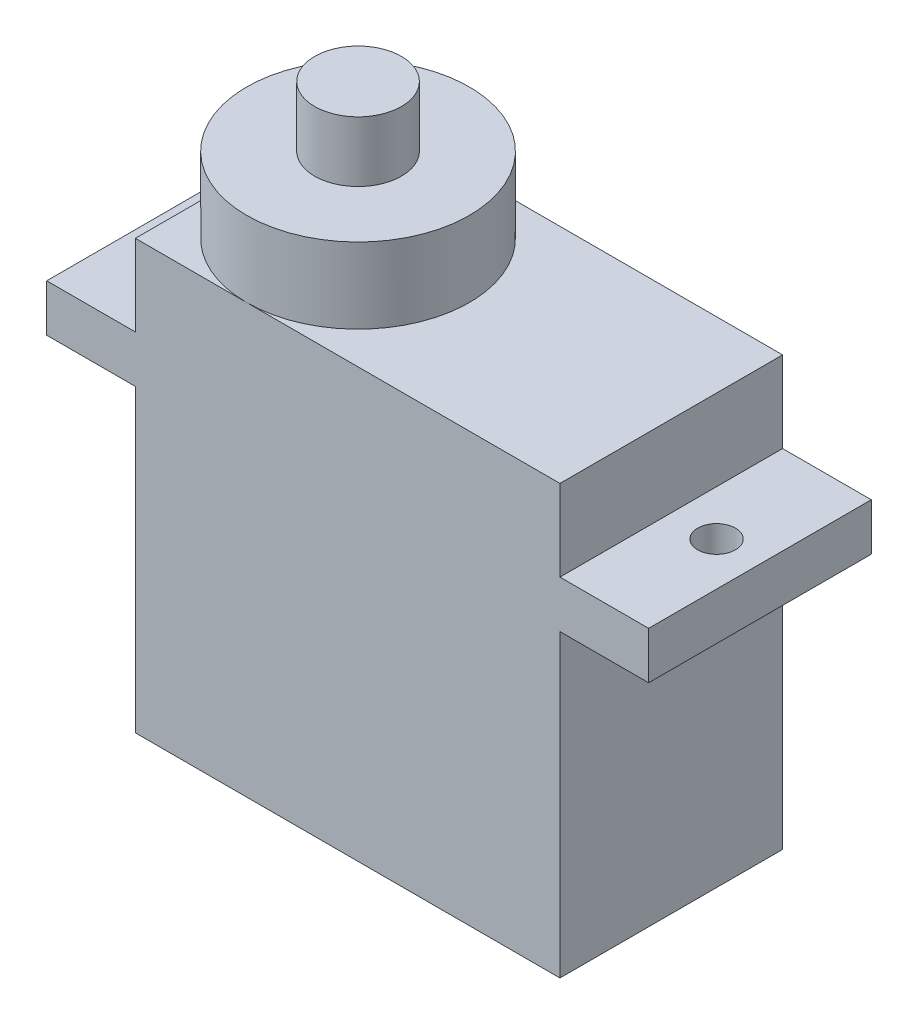
ISO-10303-21;
HEADER;
FILE_DESCRIPTION(('STEP AP214'),'2;1');
FILE_NAME('part.step','',(''),(''),'','','');
FILE_SCHEMA(('AUTOMOTIVE_DESIGN { 1 0 10303 214 1 1 1 1 }'));
ENDSEC;
DATA;
#1=APPLICATION_CONTEXT('core data for automotive mechanical design processes');
#2=APPLICATION_PROTOCOL_DEFINITION('international standard','automotive_design',2000,#1);
#3=PRODUCT_CONTEXT('',#1,'mechanical');
#4=PRODUCT('Part','Part','',(#3));
#5=PRODUCT_RELATED_PRODUCT_CATEGORY('part','',(#4));
#6=PRODUCT_DEFINITION_FORMATION('','',#4);
#7=PRODUCT_DEFINITION_CONTEXT('part definition',#1,'design');
#8=PRODUCT_DEFINITION('design','',#6,#7);
#9=PRODUCT_DEFINITION_SHAPE('','',#8);
#10=(LENGTH_UNIT() NAMED_UNIT(*) SI_UNIT(.MILLI.,.METRE.));
#11=(NAMED_UNIT(*) PLANE_ANGLE_UNIT() SI_UNIT($,.RADIAN.));
#12=(NAMED_UNIT(*) SI_UNIT($,.STERADIAN.) SOLID_ANGLE_UNIT());
#13=UNCERTAINTY_MEASURE_WITH_UNIT(LENGTH_MEASURE(1.E-05),#10,'distance_accuracy_value','');
#14=(GEOMETRIC_REPRESENTATION_CONTEXT(3) GLOBAL_UNCERTAINTY_ASSIGNED_CONTEXT((#13)) GLOBAL_UNIT_ASSIGNED_CONTEXT((#10,
#11,#12)) REPRESENTATION_CONTEXT('',''));
#15=CARTESIAN_POINT('',(0.,0.,0.));
#16=DIRECTION('',(0.,0.,1.));
#17=DIRECTION('',(1.,0.,0.));
#18=AXIS2_PLACEMENT_3D('',#15,#16,#17);
#19=CARTESIAN_POINT('',(0.,22.7,11.8));
#20=DIRECTION('',(0.,1.,0.));
#21=DIRECTION('',(0.,0.,1.));
#22=AXIS2_PLACEMENT_3D('',#19,#20,#21);
#23=PLANE('',#22);
#24=CARTESIAN_POINT('',(5.9,22.7,5.9));
#25=DIRECTION('',(0.,1.,0.));
#26=DIRECTION('',(0.,0.,1.));
#27=AXIS2_PLACEMENT_3D('',#24,#25,#26);
#28=CIRCLE('',#27,5.9);
#29=CARTESIAN_POINT('',(5.9,22.7,11.8));
#30=VERTEX_POINT('',#29);
#31=CARTESIAN_POINT('',(5.9,22.7,0.));
#32=VERTEX_POINT('',#31);
#33=EDGE_CURVE('E163',#30,#32,#28,.T.);
#34=ORIENTED_EDGE('',*,*,#33,.F.);
#35=DIRECTION('',(1.,0.,0.));
#36=VECTOR('',#35,1.);
#37=CARTESIAN_POINT('',(0.,22.7,11.8));
#38=LINE('',#37,#36);
#39=CARTESIAN_POINT('',(22.5,22.7,11.8));
#40=VERTEX_POINT('',#39);
#41=EDGE_CURVE('E149',#30,#40,#38,.T.);
#42=ORIENTED_EDGE('',*,*,#41,.T.);
#43=DIRECTION('',(0.,0.,-1.));
#44=VECTOR('',#43,1.);
#45=CARTESIAN_POINT('',(22.5,22.7,11.8));
#46=LINE('',#45,#44);
#47=CARTESIAN_POINT('',(22.5,22.7,0.));
#48=VERTEX_POINT('',#47);
#49=EDGE_CURVE('E276',#40,#48,#46,.T.);
#50=ORIENTED_EDGE('',*,*,#49,.T.);
#51=DIRECTION('',(1.,0.,0.));
#52=VECTOR('',#51,1.);
#53=CARTESIAN_POINT('',(0.,22.7,0.));
#54=LINE('',#53,#52);
#55=EDGE_CURVE('E164',#32,#48,#54,.T.);
#56=ORIENTED_EDGE('',*,*,#55,.F.);
#57=EDGE_LOOP('',(#34,#42,#50,#56));
#58=FACE_BOUND('',#57,.T.);
#59=ADVANCED_FACE('F40',(#58),#23,.T.);
#60=CARTESIAN_POINT('',(0.,22.7,5.9));
#61=VERTEX_POINT('',#60);
#62=EDGE_CURVE('E50',#32,#61,#28,.T.);
#63=ORIENTED_EDGE('',*,*,#62,.F.);
#64=CARTESIAN_POINT('',(0.,22.7,0.));
#65=VERTEX_POINT('',#64);
#66=EDGE_CURVE('E227',#65,#32,#54,.T.);
#67=ORIENTED_EDGE('',*,*,#66,.F.);
#68=DIRECTION('',(0.,0.,-1.));
#69=VECTOR('',#68,1.);
#70=CARTESIAN_POINT('',(0.,22.7,11.8));
#71=LINE('',#70,#69);
#72=EDGE_CURVE('E273',#61,#65,#71,.T.);
#73=ORIENTED_EDGE('',*,*,#72,.F.);
#74=EDGE_LOOP('',(#63,#67,#73));
#75=FACE_BOUND('',#74,.T.);
#76=ADVANCED_FACE('F349',(#75),#23,.T.);
#77=CARTESIAN_POINT('',(0.,15.9,11.8));
#78=DIRECTION('',(0.,1.,0.));
#79=DIRECTION('',(0.,0.,1.));
#80=AXIS2_PLACEMENT_3D('',#77,#78,#79);
#81=PLANE('',#80);
#82=CARTESIAN_POINT('',(24.9,15.9,5.9));
#83=DIRECTION('',(0.,1.,0.));
#84=DIRECTION('',(0.,0.,1.));
#85=AXIS2_PLACEMENT_3D('',#82,#83,#84);
#86=CIRCLE('',#85,1.);
#87=CARTESIAN_POINT('',(24.9,15.9,6.90000000000001));
#88=VERTEX_POINT('',#87);
#89=EDGE_CURVE('E313',#88,#88,#86,.T.);
#90=ORIENTED_EDGE('',*,*,#89,.T.);
#91=EDGE_LOOP('',(#90));
#92=FACE_BOUND('',#91,.T.);
#93=DIRECTION('',(1.,0.,0.));
#94=VECTOR('',#93,1.);
#95=CARTESIAN_POINT('',(0.,15.9,0.));
#96=LINE('',#95,#94);
#97=CARTESIAN_POINT('',(22.5,15.9,0.));
#98=VERTEX_POINT('',#97);
#99=CARTESIAN_POINT('',(27.2,15.9,0.));
#100=VERTEX_POINT('',#99);
#101=EDGE_CURVE('E211',#98,#100,#96,.T.);
#102=ORIENTED_EDGE('',*,*,#101,.T.);
#103=DIRECTION('',(0.,0.,-1.));
#104=VECTOR('',#103,1.);
#105=CARTESIAN_POINT('',(27.2,15.9,11.8));
#106=LINE('',#105,#104);
#107=CARTESIAN_POINT('',(27.2,15.9,11.8));
#108=VERTEX_POINT('',#107);
#109=EDGE_CURVE('E173',#108,#100,#106,.T.);
#110=ORIENTED_EDGE('',*,*,#109,.F.);
#111=DIRECTION('',(1.,0.,0.));
#112=VECTOR('',#111,1.);
#113=CARTESIAN_POINT('',(0.,15.9,11.8));
#114=LINE('',#113,#112);
#115=CARTESIAN_POINT('',(22.5,15.9,11.8));
#116=VERTEX_POINT('',#115);
#117=EDGE_CURVE('E180',#116,#108,#114,.T.);
#118=ORIENTED_EDGE('',*,*,#117,.F.);
#119=DIRECTION('',(0.,0.,-1.));
#120=VECTOR('',#119,1.);
#121=CARTESIAN_POINT('',(22.5,15.9,11.8));
#122=LINE('',#121,#120);
#123=EDGE_CURVE('E250',#116,#98,#122,.T.);
#124=ORIENTED_EDGE('',*,*,#123,.T.);
#125=EDGE_LOOP('',(#102,#110,#118,#124));
#126=FACE_BOUND('',#125,.T.);
#127=ADVANCED_FACE('F42',(#92,#126),#81,.F.);
#128=CARTESIAN_POINT('',(27.2,0.,11.8));
#129=DIRECTION('',(-1.,0.,0.));
#130=DIRECTION('',(0.,0.,1.));
#131=AXIS2_PLACEMENT_3D('',#128,#129,#130);
#132=PLANE('',#131);
#133=DIRECTION('',(0.,1.,0.));
#134=VECTOR('',#133,1.);
#135=CARTESIAN_POINT('',(27.2,0.,0.));
#136=LINE('',#135,#134);
#137=CARTESIAN_POINT('',(27.2,18.4,0.));
#138=VERTEX_POINT('',#137);
#139=EDGE_CURVE('E215',#100,#138,#136,.T.);
#140=ORIENTED_EDGE('',*,*,#139,.T.);
#141=DIRECTION('',(0.,0.,-1.));
#142=VECTOR('',#141,1.);
#143=CARTESIAN_POINT('',(27.2,18.4,11.8));
#144=LINE('',#143,#142);
#145=CARTESIAN_POINT('',(27.2,18.4,11.8));
#146=VERTEX_POINT('',#145);
#147=EDGE_CURVE('E177',#146,#138,#144,.T.);
#148=ORIENTED_EDGE('',*,*,#147,.F.);
#149=DIRECTION('',(0.,1.,0.));
#150=VECTOR('',#149,1.);
#151=CARTESIAN_POINT('',(27.2,0.,11.8));
#152=LINE('',#151,#150);
#153=EDGE_CURVE('E183',#108,#146,#152,.T.);
#154=ORIENTED_EDGE('',*,*,#153,.F.);
#155=ORIENTED_EDGE('',*,*,#109,.T.);
#156=EDGE_LOOP('',(#140,#148,#154,#155));
#157=FACE_BOUND('',#156,.T.);
#158=ADVANCED_FACE('F288',(#157),#132,.F.);
#159=CARTESIAN_POINT('',(0.,18.4,11.8));
#160=DIRECTION('',(0.,1.,0.));
#161=DIRECTION('',(0.,0.,1.));
#162=AXIS2_PLACEMENT_3D('',#159,#160,#161);
#163=PLANE('',#162);
#164=CARTESIAN_POINT('',(24.9,18.4,5.9));
#165=DIRECTION('',(0.,1.,0.));
#166=DIRECTION('',(0.,0.,1.));
#167=AXIS2_PLACEMENT_3D('',#164,#165,#166);
#168=CIRCLE('',#167,1.);
#169=CARTESIAN_POINT('',(24.9,18.4,6.90000000000001));
#170=VERTEX_POINT('',#169);
#171=EDGE_CURVE('E320',#170,#170,#168,.T.);
#172=ORIENTED_EDGE('',*,*,#171,.F.);
#173=EDGE_LOOP('',(#172));
#174=FACE_BOUND('',#173,.T.);
#175=DIRECTION('',(1.,0.,0.));
#176=VECTOR('',#175,1.);
#177=CARTESIAN_POINT('',(0.,18.4,0.));
#178=LINE('',#177,#176);
#179=CARTESIAN_POINT('',(22.5,18.4,0.));
#180=VERTEX_POINT('',#179);
#181=EDGE_CURVE('E219',#180,#138,#178,.T.);
#182=ORIENTED_EDGE('',*,*,#181,.F.);
#183=DIRECTION('',(0.,0.,-1.));
#184=VECTOR('',#183,1.);
#185=CARTESIAN_POINT('',(22.5,18.4,11.8));
#186=LINE('',#185,#184);
#187=CARTESIAN_POINT('',(22.5,18.4,11.8));
#188=VERTEX_POINT('',#187);
#189=EDGE_CURVE('E279',#188,#180,#186,.T.);
#190=ORIENTED_EDGE('',*,*,#189,.F.);
#191=DIRECTION('',(1.,0.,0.));
#192=VECTOR('',#191,1.);
#193=CARTESIAN_POINT('',(0.,18.4,11.8));
#194=LINE('',#193,#192);
#195=EDGE_CURVE('E187',#188,#146,#194,.T.);
#196=ORIENTED_EDGE('',*,*,#195,.T.);
#197=ORIENTED_EDGE('',*,*,#147,.T.);
#198=EDGE_LOOP('',(#182,#190,#196,#197));
#199=FACE_BOUND('',#198,.T.);
#200=ADVANCED_FACE('F286',(#174,#199),#163,.T.);
#201=CARTESIAN_POINT('',(22.5,0.,11.8));
#202=DIRECTION('',(-1.,0.,0.));
#203=DIRECTION('',(0.,0.,1.));
#204=AXIS2_PLACEMENT_3D('',#201,#202,#203);
#205=PLANE('',#204);
#206=DIRECTION('',(0.,1.,0.));
#207=VECTOR('',#206,1.);
#208=CARTESIAN_POINT('',(22.5,0.,0.));
#209=LINE('',#208,#207);
#210=EDGE_CURVE('E223',#180,#48,#209,.T.);
#211=ORIENTED_EDGE('',*,*,#210,.T.);
#212=ORIENTED_EDGE('',*,*,#49,.F.);
#213=DIRECTION('',(0.,1.,0.));
#214=VECTOR('',#213,1.);
#215=CARTESIAN_POINT('',(22.5,0.,11.8));
#216=LINE('',#215,#214);
#217=EDGE_CURVE('E157',#188,#40,#216,.T.);
#218=ORIENTED_EDGE('',*,*,#217,.F.);
#219=ORIENTED_EDGE('',*,*,#189,.T.);
#220=EDGE_LOOP('',(#211,#212,#218,#219));
#221=FACE_BOUND('',#220,.T.);
#222=ADVANCED_FACE('F295',(#221),#205,.F.);
#223=EDGE_CURVE('E58',#61,#30,#28,.T.);
#224=ORIENTED_EDGE('',*,*,#223,.F.);
#225=CARTESIAN_POINT('',(0.,22.7,11.8));
#226=VERTEX_POINT('',#225);
#227=EDGE_CURVE('E143',#226,#61,#71,.T.);
#228=ORIENTED_EDGE('',*,*,#227,.F.);
#229=EDGE_CURVE('E139',#226,#30,#38,.T.);
#230=ORIENTED_EDGE('',*,*,#229,.T.);
#231=EDGE_LOOP('',(#224,#228,#230));
#232=FACE_BOUND('',#231,.T.);
#233=ADVANCED_FACE('F141',(#232),#23,.T.);
#234=CARTESIAN_POINT('',(0.,0.,11.8));
#235=DIRECTION('',(-1.,0.,0.));
#236=DIRECTION('',(0.,0.,1.));
#237=AXIS2_PLACEMENT_3D('',#234,#235,#236);
#238=PLANE('',#237);
#239=DIRECTION('',(0.,1.,0.));
#240=VECTOR('',#239,1.);
#241=CARTESIAN_POINT('',(0.,0.,0.));
#242=LINE('',#241,#240);
#243=CARTESIAN_POINT('',(0.,18.4,0.));
#244=VERTEX_POINT('',#243);
#245=EDGE_CURVE('E230',#244,#65,#242,.T.);
#246=ORIENTED_EDGE('',*,*,#245,.F.);
#247=DIRECTION('',(0.,0.,-1.));
#248=VECTOR('',#247,1.);
#249=CARTESIAN_POINT('',(0.,18.4,11.8));
#250=LINE('',#249,#248);
#251=CARTESIAN_POINT('',(0.,18.4,11.8));
#252=VERTEX_POINT('',#251);
#253=EDGE_CURVE('E270',#252,#244,#250,.T.);
#254=ORIENTED_EDGE('',*,*,#253,.F.);
#255=DIRECTION('',(0.,1.,0.));
#256=VECTOR('',#255,1.);
#257=CARTESIAN_POINT('',(0.,0.,11.8));
#258=LINE('',#257,#256);
#259=EDGE_CURVE('E148',#252,#226,#258,.T.);
#260=ORIENTED_EDGE('',*,*,#259,.T.);
#261=ORIENTED_EDGE('',*,*,#227,.T.);
#262=ORIENTED_EDGE('',*,*,#72,.T.);
#263=EDGE_LOOP('',(#246,#254,#260,#261,#262));
#264=FACE_BOUND('',#263,.T.);
#265=ADVANCED_FACE('F336',(#264),#238,.T.);
#266=CARTESIAN_POINT('',(0.,18.4,11.8));
#267=DIRECTION('',(0.,1.,0.));
#268=DIRECTION('',(0.,0.,1.));
#269=AXIS2_PLACEMENT_3D('',#266,#267,#268);
#270=PLANE('',#269);
#271=CARTESIAN_POINT('',(-2.4,18.4,5.9));
#272=DIRECTION('',(0.,1.,0.));
#273=DIRECTION('',(0.,0.,1.));
#274=AXIS2_PLACEMENT_3D('',#271,#272,#273);
#275=CIRCLE('',#274,1.);
#276=CARTESIAN_POINT('',(-2.4,18.4,6.9));
#277=VERTEX_POINT('',#276);
#278=EDGE_CURVE('E323',#277,#277,#275,.T.);
#279=ORIENTED_EDGE('',*,*,#278,.F.);
#280=EDGE_LOOP('',(#279));
#281=FACE_BOUND('',#280,.T.);
#282=DIRECTION('',(1.,0.,0.));
#283=VECTOR('',#282,1.);
#284=CARTESIAN_POINT('',(0.,18.4,0.));
#285=LINE('',#284,#283);
#286=CARTESIAN_POINT('',(-4.7,18.4,0.));
#287=VERTEX_POINT('',#286);
#288=EDGE_CURVE('E234',#287,#244,#285,.T.);
#289=ORIENTED_EDGE('',*,*,#288,.F.);
#290=DIRECTION('',(0.,0.,-1.));
#291=VECTOR('',#290,1.);
#292=CARTESIAN_POINT('',(-4.7,18.4,11.8));
#293=LINE('',#292,#291);
#294=CARTESIAN_POINT('',(-4.7,18.4,11.8));
#295=VERTEX_POINT('',#294);
#296=EDGE_CURVE('E267',#295,#287,#293,.T.);
#297=ORIENTED_EDGE('',*,*,#296,.F.);
#298=DIRECTION('',(1.,0.,0.));
#299=VECTOR('',#298,1.);
#300=CARTESIAN_POINT('',(0.,18.4,11.8));
#301=LINE('',#300,#299);
#302=EDGE_CURVE('E196',#295,#252,#301,.T.);
#303=ORIENTED_EDGE('',*,*,#302,.T.);
#304=ORIENTED_EDGE('',*,*,#253,.T.);
#305=EDGE_LOOP('',(#289,#297,#303,#304));
#306=FACE_BOUND('',#305,.T.);
#307=ADVANCED_FACE('F332',(#281,#306),#270,.T.);
#308=CARTESIAN_POINT('',(-4.7,0.,11.8));
#309=DIRECTION('',(-1.,0.,0.));
#310=DIRECTION('',(0.,0.,1.));
#311=AXIS2_PLACEMENT_3D('',#308,#309,#310);
#312=PLANE('',#311);
#313=DIRECTION('',(0.,1.,0.));
#314=VECTOR('',#313,1.);
#315=CARTESIAN_POINT('',(-4.7,0.,0.));
#316=LINE('',#315,#314);
#317=CARTESIAN_POINT('',(-4.7,15.9,0.));
#318=VERTEX_POINT('',#317);
#319=EDGE_CURVE('E239',#318,#287,#316,.T.);
#320=ORIENTED_EDGE('',*,*,#319,.F.);
#321=DIRECTION('',(0.,0.,-1.));
#322=VECTOR('',#321,1.);
#323=CARTESIAN_POINT('',(-4.7,15.9,11.8));
#324=LINE('',#323,#322);
#325=CARTESIAN_POINT('',(-4.7,15.9,11.8));
#326=VERTEX_POINT('',#325);
#327=EDGE_CURVE('E264',#326,#318,#324,.T.);
#328=ORIENTED_EDGE('',*,*,#327,.F.);
#329=DIRECTION('',(0.,1.,0.));
#330=VECTOR('',#329,1.);
#331=CARTESIAN_POINT('',(-4.7,0.,11.8));
#332=LINE('',#331,#330);
#333=EDGE_CURVE('E201',#326,#295,#332,.T.);
#334=ORIENTED_EDGE('',*,*,#333,.T.);
#335=ORIENTED_EDGE('',*,*,#296,.T.);
#336=EDGE_LOOP('',(#320,#328,#334,#335));
#337=FACE_BOUND('',#336,.T.);
#338=ADVANCED_FACE('F335',(#337),#312,.T.);
#339=CARTESIAN_POINT('',(0.,15.9,11.8));
#340=DIRECTION('',(0.,1.,0.));
#341=DIRECTION('',(0.,0.,1.));
#342=AXIS2_PLACEMENT_3D('',#339,#340,#341);
#343=PLANE('',#342);
#344=CARTESIAN_POINT('',(-2.4,15.9,5.9));
#345=DIRECTION('',(0.,1.,0.));
#346=DIRECTION('',(0.,0.,1.));
#347=AXIS2_PLACEMENT_3D('',#344,#345,#346);
#348=CIRCLE('',#347,1.);
#349=CARTESIAN_POINT('',(-2.4,15.9,6.9));
#350=VERTEX_POINT('',#349);
#351=EDGE_CURVE('E44',#350,#350,#348,.T.);
#352=ORIENTED_EDGE('',*,*,#351,.T.);
#353=EDGE_LOOP('',(#352));
#354=FACE_BOUND('',#353,.T.);
#355=DIRECTION('',(1.,0.,0.));
#356=VECTOR('',#355,1.);
#357=CARTESIAN_POINT('',(0.,15.9,0.));
#358=LINE('',#357,#356);
#359=CARTESIAN_POINT('',(0.,15.9,0.));
#360=VERTEX_POINT('',#359);
#361=EDGE_CURVE('E243',#318,#360,#358,.T.);
#362=ORIENTED_EDGE('',*,*,#361,.T.);
#363=DIRECTION('',(0.,0.,-1.));
#364=VECTOR('',#363,1.);
#365=CARTESIAN_POINT('',(0.,15.9,11.8));
#366=LINE('',#365,#364);
#367=CARTESIAN_POINT('',(0.,15.9,11.8));
#368=VERTEX_POINT('',#367);
#369=EDGE_CURVE('E261',#368,#360,#366,.T.);
#370=ORIENTED_EDGE('',*,*,#369,.F.);
#371=DIRECTION('',(1.,0.,0.));
#372=VECTOR('',#371,1.);
#373=CARTESIAN_POINT('',(0.,15.9,11.8));
#374=LINE('',#373,#372);
#375=EDGE_CURVE('E205',#326,#368,#374,.T.);
#376=ORIENTED_EDGE('',*,*,#375,.F.);
#377=ORIENTED_EDGE('',*,*,#327,.T.);
#378=EDGE_LOOP('',(#362,#370,#376,#377));
#379=FACE_BOUND('',#378,.T.);
#380=ADVANCED_FACE('F387',(#354,#379),#343,.F.);
#381=CARTESIAN_POINT('',(0.,0.,0.));
#382=VERTEX_POINT('',#381);
#383=EDGE_CURVE('E235',#382,#360,#242,.T.);
#384=ORIENTED_EDGE('',*,*,#383,.F.);
#385=DIRECTION('',(0.,0.,-1.));
#386=VECTOR('',#385,1.);
#387=CARTESIAN_POINT('',(0.,0.,11.8));
#388=LINE('',#387,#386);
#389=CARTESIAN_POINT('',(0.,0.,11.8));
#390=VERTEX_POINT('',#389);
#391=EDGE_CURVE('E258',#390,#382,#388,.T.);
#392=ORIENTED_EDGE('',*,*,#391,.F.);
#393=EDGE_CURVE('E197',#390,#368,#258,.T.);
#394=ORIENTED_EDGE('',*,*,#393,.T.);
#395=ORIENTED_EDGE('',*,*,#369,.T.);
#396=EDGE_LOOP('',(#384,#392,#394,#395));
#397=FACE_BOUND('',#396,.T.);
#398=ADVANCED_FACE('F355',(#397),#238,.T.);
#399=CARTESIAN_POINT('',(0.,0.,11.8));
#400=DIRECTION('',(0.,1.,0.));
#401=DIRECTION('',(0.,0.,1.));
#402=AXIS2_PLACEMENT_3D('',#399,#400,#401);
#403=PLANE('',#402);
#404=DIRECTION('',(1.,0.,0.));
#405=VECTOR('',#404,1.);
#406=CARTESIAN_POINT('',(0.,0.,0.));
#407=LINE('',#406,#405);
#408=CARTESIAN_POINT('',(22.5,0.,0.));
#409=VERTEX_POINT('',#408);
#410=EDGE_CURVE('E247',#382,#409,#407,.T.);
#411=ORIENTED_EDGE('',*,*,#410,.T.);
#412=DIRECTION('',(0.,0.,-1.));
#413=VECTOR('',#412,1.);
#414=CARTESIAN_POINT('',(22.5,0.,11.8));
#415=LINE('',#414,#413);
#416=CARTESIAN_POINT('',(22.5,0.,11.8));
#417=VERTEX_POINT('',#416);
#418=EDGE_CURVE('E254',#417,#409,#415,.T.);
#419=ORIENTED_EDGE('',*,*,#418,.F.);
#420=DIRECTION('',(1.,0.,0.));
#421=VECTOR('',#420,1.);
#422=CARTESIAN_POINT('',(0.,0.,11.8));
#423=LINE('',#422,#421);
#424=EDGE_CURVE('E208',#390,#417,#423,.T.);
#425=ORIENTED_EDGE('',*,*,#424,.F.);
#426=ORIENTED_EDGE('',*,*,#391,.T.);
#427=EDGE_LOOP('',(#411,#419,#425,#426));
#428=FACE_BOUND('',#427,.T.);
#429=ADVANCED_FACE('F359',(#428),#403,.F.);
#430=EDGE_CURVE('E184',#409,#98,#209,.T.);
#431=ORIENTED_EDGE('',*,*,#430,.T.);
#432=ORIENTED_EDGE('',*,*,#123,.F.);
#433=EDGE_CURVE('E192',#417,#116,#216,.T.);
#434=ORIENTED_EDGE('',*,*,#433,.F.);
#435=ORIENTED_EDGE('',*,*,#418,.T.);
#436=EDGE_LOOP('',(#431,#432,#434,#435));
#437=FACE_BOUND('',#436,.T.);
#438=ADVANCED_FACE('F360',(#437),#205,.F.);
#439=CARTESIAN_POINT('',(0.,0.,11.8));
#440=DIRECTION('',(0.,0.,1.));
#441=DIRECTION('',(1.,0.,0.));
#442=AXIS2_PLACEMENT_3D('',#439,#440,#441);
#443=PLANE('',#442);
#444=ORIENTED_EDGE('',*,*,#117,.T.);
#445=ORIENTED_EDGE('',*,*,#153,.T.);
#446=ORIENTED_EDGE('',*,*,#195,.F.);
#447=ORIENTED_EDGE('',*,*,#217,.T.);
#448=ORIENTED_EDGE('',*,*,#41,.F.);
#449=ORIENTED_EDGE('',*,*,#229,.F.);
#450=ORIENTED_EDGE('',*,*,#259,.F.);
#451=ORIENTED_EDGE('',*,*,#302,.F.);
#452=ORIENTED_EDGE('',*,*,#333,.F.);
#453=ORIENTED_EDGE('',*,*,#375,.T.);
#454=ORIENTED_EDGE('',*,*,#393,.F.);
#455=ORIENTED_EDGE('',*,*,#424,.T.);
#456=ORIENTED_EDGE('',*,*,#433,.T.);
#457=EDGE_LOOP('',(#444,#445,#446,#447,#448,#449,#450,#451,#452,#453,#454,#455,#456));
#458=FACE_BOUND('',#457,.T.);
#459=ADVANCED_FACE('F154',(#458),#443,.T.);
#460=CARTESIAN_POINT('',(0.,0.,0.));
#461=DIRECTION('',(0.,0.,1.));
#462=DIRECTION('',(1.,0.,0.));
#463=AXIS2_PLACEMENT_3D('',#460,#461,#462);
#464=PLANE('',#463);
#465=ORIENTED_EDGE('',*,*,#101,.F.);
#466=ORIENTED_EDGE('',*,*,#430,.F.);
#467=ORIENTED_EDGE('',*,*,#410,.F.);
#468=ORIENTED_EDGE('',*,*,#383,.T.);
#469=ORIENTED_EDGE('',*,*,#361,.F.);
#470=ORIENTED_EDGE('',*,*,#319,.T.);
#471=ORIENTED_EDGE('',*,*,#288,.T.);
#472=ORIENTED_EDGE('',*,*,#245,.T.);
#473=ORIENTED_EDGE('',*,*,#66,.T.);
#474=ORIENTED_EDGE('',*,*,#55,.T.);
#475=ORIENTED_EDGE('',*,*,#210,.F.);
#476=ORIENTED_EDGE('',*,*,#181,.T.);
#477=ORIENTED_EDGE('',*,*,#139,.F.);
#478=EDGE_LOOP('',(#465,#466,#467,#468,#469,#470,#471,#472,#473,#474,#475,#476,#477));
#479=FACE_BOUND('',#478,.T.);
#480=ADVANCED_FACE('F293',(#479),#464,.F.);
#481=CARTESIAN_POINT('',(5.9,26.7,5.9));
#482=DIRECTION('',(0.,-1.,0.));
#483=DIRECTION('',(0.,0.,-1.));
#484=AXIS2_PLACEMENT_3D('',#481,#482,#483);
#485=CYLINDRICAL_SURFACE('',#484,5.9);
#486=CARTESIAN_POINT('',(5.9,26.7,5.9));
#487=DIRECTION('',(0.,1.,0.));
#488=DIRECTION('',(0.,0.,1.));
#489=AXIS2_PLACEMENT_3D('',#486,#487,#488);
#490=CIRCLE('',#489,5.9);
#491=CARTESIAN_POINT('',(5.9,26.7,11.8));
#492=VERTEX_POINT('',#491);
#493=EDGE_CURVE('E168',#492,#492,#490,.T.);
#494=ORIENTED_EDGE('',*,*,#493,.F.);
#495=EDGE_LOOP('',(#494));
#496=FACE_BOUND('',#495,.T.);
#497=ORIENTED_EDGE('',*,*,#33,.T.);
#498=ORIENTED_EDGE('',*,*,#62,.T.);
#499=ORIENTED_EDGE('',*,*,#223,.T.);
#500=EDGE_LOOP('',(#497,#498,#499));
#501=FACE_BOUND('',#500,.T.);
#502=ADVANCED_FACE('F171',(#496,#501),#485,.T.);
#503=CARTESIAN_POINT('',(5.9,26.7,5.9));
#504=DIRECTION('',(0.,1.,0.));
#505=DIRECTION('',(0.,0.,1.));
#506=AXIS2_PLACEMENT_3D('',#503,#504,#505);
#507=PLANE('',#506);
#508=CARTESIAN_POINT('',(5.9,26.7,5.9));
#509=DIRECTION('',(0.,1.,0.));
#510=DIRECTION('',(0.,0.,1.));
#511=AXIS2_PLACEMENT_3D('',#508,#509,#510);
#512=CIRCLE('',#511,2.3);
#513=CARTESIAN_POINT('',(5.9,26.7,8.2));
#514=VERTEX_POINT('',#513);
#515=EDGE_CURVE('E11',#514,#514,#512,.T.);
#516=ORIENTED_EDGE('',*,*,#515,.F.);
#517=EDGE_LOOP('',(#516));
#518=FACE_BOUND('',#517,.T.);
#519=ORIENTED_EDGE('',*,*,#493,.T.);
#520=EDGE_LOOP('',(#519));
#521=FACE_BOUND('',#520,.T.);
#522=ADVANCED_FACE('F414',(#518,#521),#507,.T.);
#523=CARTESIAN_POINT('',(5.9,29.9,5.9));
#524=DIRECTION('',(0.,-1.,0.));
#525=DIRECTION('',(0.,0.,-1.));
#526=AXIS2_PLACEMENT_3D('',#523,#524,#525);
#527=CYLINDRICAL_SURFACE('',#526,2.3);
#528=CARTESIAN_POINT('',(5.9,29.9,5.9));
#529=DIRECTION('',(0.,1.,0.));
#530=DIRECTION('',(0.,0.,1.));
#531=AXIS2_PLACEMENT_3D('',#528,#529,#530);
#532=CIRCLE('',#531,2.3);
#533=CARTESIAN_POINT('',(5.9,29.9,8.2));
#534=VERTEX_POINT('',#533);
#535=EDGE_CURVE('E169',#534,#534,#532,.T.);
#536=ORIENTED_EDGE('',*,*,#535,.F.);
#537=EDGE_LOOP('',(#536));
#538=FACE_BOUND('',#537,.T.);
#539=ORIENTED_EDGE('',*,*,#515,.T.);
#540=EDGE_LOOP('',(#539));
#541=FACE_BOUND('',#540,.T.);
#542=ADVANCED_FACE('F408',(#538,#541),#527,.T.);
#543=CARTESIAN_POINT('',(0.,29.9,0.));
#544=DIRECTION('',(0.,1.,0.));
#545=DIRECTION('',(0.,0.,1.));
#546=AXIS2_PLACEMENT_3D('',#543,#544,#545);
#547=PLANE('',#546);
#548=ORIENTED_EDGE('',*,*,#535,.T.);
#549=EDGE_LOOP('',(#548));
#550=FACE_BOUND('',#549,.T.);
#551=ADVANCED_FACE('F401',(#550),#547,.T.);
#552=CARTESIAN_POINT('',(-2.4,8.4,5.9));
#553=DIRECTION('',(0.,1.,0.));
#554=DIRECTION('',(0.,0.,1.));
#555=AXIS2_PLACEMENT_3D('',#552,#553,#554);
#556=CYLINDRICAL_SURFACE('',#555,1.);
#557=ORIENTED_EDGE('',*,*,#278,.T.);
#558=EDGE_LOOP('',(#557));
#559=FACE_BOUND('',#558,.T.);
#560=ORIENTED_EDGE('',*,*,#351,.F.);
#561=EDGE_LOOP('',(#560));
#562=FACE_BOUND('',#561,.T.);
#563=ADVANCED_FACE('F329',(#559,#562),#556,.F.);
#564=CARTESIAN_POINT('',(24.9,8.4,5.9));
#565=DIRECTION('',(0.,1.,0.));
#566=DIRECTION('',(0.,0.,1.));
#567=AXIS2_PLACEMENT_3D('',#564,#565,#566);
#568=CYLINDRICAL_SURFACE('',#567,1.);
#569=ORIENTED_EDGE('',*,*,#171,.T.);
#570=EDGE_LOOP('',(#569));
#571=FACE_BOUND('',#570,.T.);
#572=ORIENTED_EDGE('',*,*,#89,.F.);
#573=EDGE_LOOP('',(#572));
#574=FACE_BOUND('',#573,.T.);
#575=ADVANCED_FACE('F400',(#571,#574),#568,.F.);
#576=CLOSED_SHELL('',(#59,#76,#127,#158,#200,#222,#233,#265,#307,#338,#380,#398,#429,#438,#459,
#480,#502,#522,#542,#551,#563,#575));
#577=MANIFOLD_SOLID_BREP('B2',#576);
#578=ADVANCED_BREP_SHAPE_REPRESENTATION('',(#18,#577),#14);
#579=SHAPE_DEFINITION_REPRESENTATION(#9,#578);
ENDSEC;
END-ISO-10303-21;
